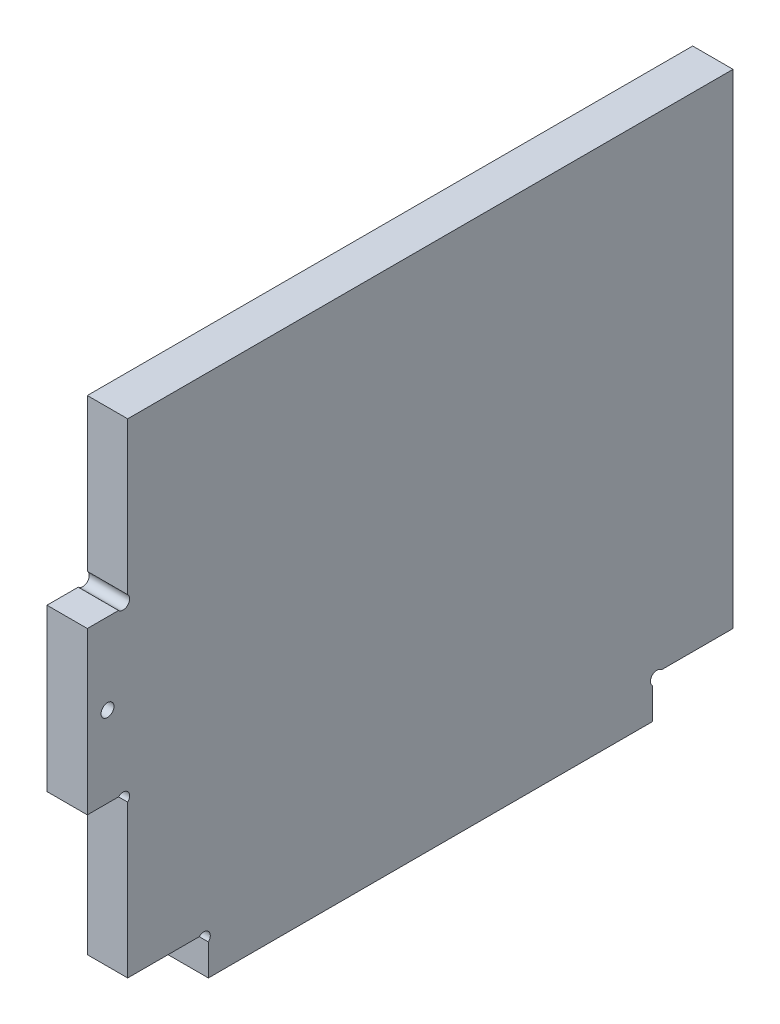
ISO-10303-21;
HEADER;
FILE_DESCRIPTION(('STEP AP214'),'2;1');
FILE_NAME('part.step','',(''),(''),'','','');
FILE_SCHEMA(('AUTOMOTIVE_DESIGN { 1 0 10303 214 1 1 1 1 }'));
ENDSEC;
DATA;
#1=APPLICATION_CONTEXT('core data for automotive mechanical design processes');
#2=APPLICATION_PROTOCOL_DEFINITION('international standard','automotive_design',2000,#1);
#3=PRODUCT_CONTEXT('',#1,'mechanical');
#4=PRODUCT('Part','Part','',(#3));
#5=PRODUCT_RELATED_PRODUCT_CATEGORY('part','',(#4));
#6=PRODUCT_DEFINITION_FORMATION('','',#4);
#7=PRODUCT_DEFINITION_CONTEXT('part definition',#1,'design');
#8=PRODUCT_DEFINITION('design','',#6,#7);
#9=PRODUCT_DEFINITION_SHAPE('','',#8);
#10=(LENGTH_UNIT() NAMED_UNIT(*) SI_UNIT(.MILLI.,.METRE.));
#11=(NAMED_UNIT(*) PLANE_ANGLE_UNIT() SI_UNIT($,.RADIAN.));
#12=(NAMED_UNIT(*) SI_UNIT($,.STERADIAN.) SOLID_ANGLE_UNIT());
#13=UNCERTAINTY_MEASURE_WITH_UNIT(LENGTH_MEASURE(1.E-05),#10,'distance_accuracy_value','');
#14=(GEOMETRIC_REPRESENTATION_CONTEXT(3) GLOBAL_UNCERTAINTY_ASSIGNED_CONTEXT((#13)) GLOBAL_UNIT_ASSIGNED_CONTEXT((#10,
#11,#12)) REPRESENTATION_CONTEXT('',''));
#15=CARTESIAN_POINT('',(0.,0.,0.));
#16=DIRECTION('',(0.,0.,1.));
#17=DIRECTION('',(1.,0.,0.));
#18=AXIS2_PLACEMENT_3D('',#15,#16,#17);
#19=CARTESIAN_POINT('',(10.,8.86862915010153,-141.131370849899));
#20=DIRECTION('',(1.,0.,0.));
#21=DIRECTION('',(0.,0.,-1.));
#22=AXIS2_PLACEMENT_3D('',#19,#20,#21);
#23=PLANE('',#22);
#24=CARTESIAN_POINT('',(10.,8.86862915010153,-141.131370849899));
#25=DIRECTION('',(-1.,0.,0.));
#26=DIRECTION('',(0.,0.,-1.));
#27=AXIS2_PLACEMENT_3D('',#24,#25,#26);
#28=CIRCLE('',#27,1.59999999999999);
#29=CARTESIAN_POINT('',(10.,7.73725830020309,-140.));
#30=VERTEX_POINT('',#29);
#31=CARTESIAN_POINT('',(10.,10.,-142.262741699797));
#32=VERTEX_POINT('',#31);
#33=EDGE_CURVE('E192',#30,#32,#28,.T.);
#34=ORIENTED_EDGE('',*,*,#33,.T.);
#35=DIRECTION('',(0.,0.,-1.));
#36=VECTOR('',#35,1.);
#37=CARTESIAN_POINT('',(10.,10.,-160.));
#38=LINE('',#37,#36);
#39=CARTESIAN_POINT('',(10.,10.,-160.));
#40=VERTEX_POINT('',#39);
#41=EDGE_CURVE('E153',#32,#40,#38,.T.);
#42=ORIENTED_EDGE('',*,*,#41,.T.);
#43=DIRECTION('',(0.,1.,0.));
#44=VECTOR('',#43,1.);
#45=CARTESIAN_POINT('',(10.,130.,-160.));
#46=LINE('',#45,#44);
#47=CARTESIAN_POINT('',(10.,130.,-160.));
#48=VERTEX_POINT('',#47);
#49=EDGE_CURVE('E195',#40,#48,#46,.T.);
#50=ORIENTED_EDGE('',*,*,#49,.T.);
#51=DIRECTION('',(0.,0.,1.));
#52=VECTOR('',#51,1.);
#53=CARTESIAN_POINT('',(10.,130.,-10.));
#54=LINE('',#53,#52);
#55=CARTESIAN_POINT('',(10.,130.,-10.));
#56=VERTEX_POINT('',#55);
#57=EDGE_CURVE('E197',#48,#56,#54,.T.);
#58=ORIENTED_EDGE('',*,*,#57,.T.);
#59=DIRECTION('',(0.,-1.,0.));
#60=VECTOR('',#59,1.);
#61=CARTESIAN_POINT('',(10.,92.262741699797,-10.));
#62=LINE('',#61,#60);
#63=CARTESIAN_POINT('',(10.,92.262741699797,-10.));
#64=VERTEX_POINT('',#63);
#65=EDGE_CURVE('E199',#56,#64,#62,.T.);
#66=ORIENTED_EDGE('',*,*,#65,.T.);
#67=CARTESIAN_POINT('',(10.,91.1313708498985,-8.86862915010154));
#68=DIRECTION('',(-1.,0.,0.));
#69=DIRECTION('',(0.,0.,1.));
#70=AXIS2_PLACEMENT_3D('',#67,#68,#69);
#71=CIRCLE('',#70,1.6);
#72=CARTESIAN_POINT('',(10.,90.,-7.73725830020305));
#73=VERTEX_POINT('',#72);
#74=EDGE_CURVE('E201',#64,#73,#71,.T.);
#75=ORIENTED_EDGE('',*,*,#74,.T.);
#76=DIRECTION('',(0.,0.,1.));
#77=VECTOR('',#76,1.);
#78=CARTESIAN_POINT('',(10.,90.,0.));
#79=LINE('',#78,#77);
#80=CARTESIAN_POINT('',(10.,90.,0.));
#81=VERTEX_POINT('',#80);
#82=EDGE_CURVE('E203',#73,#81,#79,.T.);
#83=ORIENTED_EDGE('',*,*,#82,.T.);
#84=DIRECTION('',(0.,-1.,0.));
#85=VECTOR('',#84,1.);
#86=CARTESIAN_POINT('',(10.,50.,0.));
#87=LINE('',#86,#85);
#88=CARTESIAN_POINT('',(10.,50.,0.));
#89=VERTEX_POINT('',#88);
#90=EDGE_CURVE('E205',#81,#89,#87,.T.);
#91=ORIENTED_EDGE('',*,*,#90,.T.);
#92=DIRECTION('',(0.,0.,-1.));
#93=VECTOR('',#92,1.);
#94=CARTESIAN_POINT('',(10.,50.,0.));
#95=LINE('',#94,#93);
#96=CARTESIAN_POINT('',(10.,50.,-7.73725830020305));
#97=VERTEX_POINT('',#96);
#98=EDGE_CURVE('E207',#89,#97,#95,.T.);
#99=ORIENTED_EDGE('',*,*,#98,.T.);
#100=CARTESIAN_POINT('',(10.,48.8686291501015,-8.86862915010154));
#101=DIRECTION('',(-1.,0.,0.));
#102=DIRECTION('',(0.,0.,-1.));
#103=AXIS2_PLACEMENT_3D('',#100,#101,#102);
#104=CIRCLE('',#103,1.6);
#105=CARTESIAN_POINT('',(10.,47.7372583002031,-10.));
#106=VERTEX_POINT('',#105);
#107=EDGE_CURVE('E209',#97,#106,#104,.T.);
#108=ORIENTED_EDGE('',*,*,#107,.T.);
#109=DIRECTION('',(0.,-1.,0.));
#110=VECTOR('',#109,1.);
#111=CARTESIAN_POINT('',(10.,10.,-10.));
#112=LINE('',#111,#110);
#113=CARTESIAN_POINT('',(10.,10.,-10.));
#114=VERTEX_POINT('',#113);
#115=EDGE_CURVE('E211',#106,#114,#112,.T.);
#116=ORIENTED_EDGE('',*,*,#115,.T.);
#117=DIRECTION('',(0.,0.,-1.));
#118=VECTOR('',#117,1.);
#119=CARTESIAN_POINT('',(10.,10.,-27.7372583002031));
#120=LINE('',#119,#118);
#121=CARTESIAN_POINT('',(10.,10.,-27.7372583002031));
#122=VERTEX_POINT('',#121);
#123=EDGE_CURVE('E213',#114,#122,#120,.T.);
#124=ORIENTED_EDGE('',*,*,#123,.T.);
#125=CARTESIAN_POINT('',(10.,8.86862915010153,-28.8686291501015));
#126=DIRECTION('',(-1.,0.,0.));
#127=DIRECTION('',(0.,0.,1.));
#128=AXIS2_PLACEMENT_3D('',#125,#126,#127);
#129=CIRCLE('',#128,1.59999999999999);
#130=CARTESIAN_POINT('',(10.,7.73725830020309,-30.));
#131=VERTEX_POINT('',#130);
#132=EDGE_CURVE('E215',#122,#131,#129,.T.);
#133=ORIENTED_EDGE('',*,*,#132,.T.);
#134=DIRECTION('',(0.,-1.,0.));
#135=VECTOR('',#134,1.);
#136=CARTESIAN_POINT('',(10.,7.73725830020309,-30.));
#137=LINE('',#136,#135);
#138=CARTESIAN_POINT('',(10.,0.,-30.));
#139=VERTEX_POINT('',#138);
#140=EDGE_CURVE('E217',#131,#139,#137,.T.);
#141=ORIENTED_EDGE('',*,*,#140,.T.);
#142=DIRECTION('',(0.,0.,-1.));
#143=VECTOR('',#142,1.);
#144=CARTESIAN_POINT('',(10.,0.,-30.));
#145=LINE('',#144,#143);
#146=CARTESIAN_POINT('',(10.,0.,-140.));
#147=VERTEX_POINT('',#146);
#148=EDGE_CURVE('E46',#139,#147,#145,.T.);
#149=ORIENTED_EDGE('',*,*,#148,.T.);
#150=DIRECTION('',(0.,1.,0.));
#151=VECTOR('',#150,1.);
#152=CARTESIAN_POINT('',(10.,7.73725830020309,-140.));
#153=LINE('',#152,#151);
#154=EDGE_CURVE('E41',#147,#30,#153,.T.);
#155=ORIENTED_EDGE('',*,*,#154,.T.);
#156=EDGE_LOOP('',(#34,#42,#50,#58,#66,#75,#83,#91,#99,#108,#116,#124,#133,#141,#149,#155));
#157=FACE_BOUND('',#156,.T.);
#158=CARTESIAN_POINT('',(10.,70.,-5.));
#159=DIRECTION('',(1.,0.,0.));
#160=DIRECTION('',(0.,0.,-1.));
#161=AXIS2_PLACEMENT_3D('',#158,#159,#160);
#162=CIRCLE('',#161,1.6);
#163=CARTESIAN_POINT('',(10.,70.,-6.6));
#164=VERTEX_POINT('',#163);
#165=EDGE_CURVE('E158',#164,#164,#162,.T.);
#166=ORIENTED_EDGE('',*,*,#165,.F.);
#167=EDGE_LOOP('',(#166));
#168=FACE_BOUND('',#167,.T.);
#169=ADVANCED_FACE('F26',(#157,#168),#23,.T.);
#170=CARTESIAN_POINT('',(0.,8.86862915010153,-141.131370849899));
#171=DIRECTION('',(1.,0.,0.));
#172=DIRECTION('',(0.,0.,-1.));
#173=AXIS2_PLACEMENT_3D('',#170,#171,#172);
#174=PLANE('',#173);
#175=CARTESIAN_POINT('',(0.,8.86862915010153,-141.131370849899));
#176=DIRECTION('',(-1.,0.,0.));
#177=DIRECTION('',(0.,0.,-1.));
#178=AXIS2_PLACEMENT_3D('',#175,#176,#177);
#179=CIRCLE('',#178,1.59999999999999);
#180=CARTESIAN_POINT('',(0.,7.73725830020309,-140.));
#181=VERTEX_POINT('',#180);
#182=CARTESIAN_POINT('',(0.,10.,-142.262741699797));
#183=VERTEX_POINT('',#182);
#184=EDGE_CURVE('E144',#181,#183,#179,.T.);
#185=ORIENTED_EDGE('',*,*,#184,.F.);
#186=DIRECTION('',(0.,1.,0.));
#187=VECTOR('',#186,1.);
#188=CARTESIAN_POINT('',(0.,7.73725830020309,-140.));
#189=LINE('',#188,#187);
#190=CARTESIAN_POINT('',(0.,0.,-140.));
#191=VERTEX_POINT('',#190);
#192=EDGE_CURVE('E190',#191,#181,#189,.T.);
#193=ORIENTED_EDGE('',*,*,#192,.F.);
#194=DIRECTION('',(0.,0.,-1.));
#195=VECTOR('',#194,1.);
#196=CARTESIAN_POINT('',(0.,0.,-30.));
#197=LINE('',#196,#195);
#198=CARTESIAN_POINT('',(0.,0.,-30.));
#199=VERTEX_POINT('',#198);
#200=EDGE_CURVE('E188',#199,#191,#197,.T.);
#201=ORIENTED_EDGE('',*,*,#200,.F.);
#202=DIRECTION('',(0.,-1.,0.));
#203=VECTOR('',#202,1.);
#204=CARTESIAN_POINT('',(0.,7.73725830020309,-30.));
#205=LINE('',#204,#203);
#206=CARTESIAN_POINT('',(0.,7.73725830020309,-30.));
#207=VERTEX_POINT('',#206);
#208=EDGE_CURVE('E186',#207,#199,#205,.T.);
#209=ORIENTED_EDGE('',*,*,#208,.F.);
#210=CARTESIAN_POINT('',(0.,8.86862915010153,-28.8686291501015));
#211=DIRECTION('',(-1.,0.,0.));
#212=DIRECTION('',(0.,0.,1.));
#213=AXIS2_PLACEMENT_3D('',#210,#211,#212);
#214=CIRCLE('',#213,1.59999999999999);
#215=CARTESIAN_POINT('',(0.,10.,-27.7372583002031));
#216=VERTEX_POINT('',#215);
#217=EDGE_CURVE('E184',#216,#207,#214,.T.);
#218=ORIENTED_EDGE('',*,*,#217,.F.);
#219=DIRECTION('',(0.,0.,-1.));
#220=VECTOR('',#219,1.);
#221=CARTESIAN_POINT('',(0.,10.,-27.7372583002031));
#222=LINE('',#221,#220);
#223=CARTESIAN_POINT('',(0.,10.,-10.));
#224=VERTEX_POINT('',#223);
#225=EDGE_CURVE('E182',#224,#216,#222,.T.);
#226=ORIENTED_EDGE('',*,*,#225,.F.);
#227=DIRECTION('',(0.,-1.,0.));
#228=VECTOR('',#227,1.);
#229=CARTESIAN_POINT('',(0.,10.,-10.));
#230=LINE('',#229,#228);
#231=CARTESIAN_POINT('',(0.,47.7372583002031,-10.));
#232=VERTEX_POINT('',#231);
#233=EDGE_CURVE('E180',#232,#224,#230,.T.);
#234=ORIENTED_EDGE('',*,*,#233,.F.);
#235=CARTESIAN_POINT('',(0.,48.8686291501015,-8.86862915010154));
#236=DIRECTION('',(-1.,0.,0.));
#237=DIRECTION('',(0.,0.,-1.));
#238=AXIS2_PLACEMENT_3D('',#235,#236,#237);
#239=CIRCLE('',#238,1.6);
#240=CARTESIAN_POINT('',(0.,50.,-7.73725830020305));
#241=VERTEX_POINT('',#240);
#242=EDGE_CURVE('E178',#241,#232,#239,.T.);
#243=ORIENTED_EDGE('',*,*,#242,.F.);
#244=DIRECTION('',(0.,0.,-1.));
#245=VECTOR('',#244,1.);
#246=CARTESIAN_POINT('',(0.,50.,0.));
#247=LINE('',#246,#245);
#248=CARTESIAN_POINT('',(0.,50.,0.));
#249=VERTEX_POINT('',#248);
#250=EDGE_CURVE('E176',#249,#241,#247,.T.);
#251=ORIENTED_EDGE('',*,*,#250,.F.);
#252=DIRECTION('',(0.,-1.,0.));
#253=VECTOR('',#252,1.);
#254=CARTESIAN_POINT('',(0.,50.,0.));
#255=LINE('',#254,#253);
#256=CARTESIAN_POINT('',(0.,90.,0.));
#257=VERTEX_POINT('',#256);
#258=EDGE_CURVE('E174',#257,#249,#255,.T.);
#259=ORIENTED_EDGE('',*,*,#258,.F.);
#260=DIRECTION('',(0.,0.,1.));
#261=VECTOR('',#260,1.);
#262=CARTESIAN_POINT('',(0.,90.,0.));
#263=LINE('',#262,#261);
#264=CARTESIAN_POINT('',(0.,90.,-7.73725830020305));
#265=VERTEX_POINT('',#264);
#266=EDGE_CURVE('E172',#265,#257,#263,.T.);
#267=ORIENTED_EDGE('',*,*,#266,.F.);
#268=CARTESIAN_POINT('',(0.,91.1313708498985,-8.86862915010154));
#269=DIRECTION('',(-1.,0.,0.));
#270=DIRECTION('',(0.,0.,1.));
#271=AXIS2_PLACEMENT_3D('',#268,#269,#270);
#272=CIRCLE('',#271,1.6);
#273=CARTESIAN_POINT('',(0.,92.262741699797,-10.));
#274=VERTEX_POINT('',#273);
#275=EDGE_CURVE('E170',#274,#265,#272,.T.);
#276=ORIENTED_EDGE('',*,*,#275,.F.);
#277=DIRECTION('',(0.,-1.,0.));
#278=VECTOR('',#277,1.);
#279=CARTESIAN_POINT('',(0.,92.262741699797,-10.));
#280=LINE('',#279,#278);
#281=CARTESIAN_POINT('',(0.,130.,-10.));
#282=VERTEX_POINT('',#281);
#283=EDGE_CURVE('E168',#282,#274,#280,.T.);
#284=ORIENTED_EDGE('',*,*,#283,.F.);
#285=DIRECTION('',(0.,0.,1.));
#286=VECTOR('',#285,1.);
#287=CARTESIAN_POINT('',(0.,130.,-10.));
#288=LINE('',#287,#286);
#289=CARTESIAN_POINT('',(0.,130.,-160.));
#290=VERTEX_POINT('',#289);
#291=EDGE_CURVE('E166',#290,#282,#288,.T.);
#292=ORIENTED_EDGE('',*,*,#291,.F.);
#293=DIRECTION('',(0.,1.,0.));
#294=VECTOR('',#293,1.);
#295=CARTESIAN_POINT('',(0.,130.,-160.));
#296=LINE('',#295,#294);
#297=CARTESIAN_POINT('',(0.,10.,-160.));
#298=VERTEX_POINT('',#297);
#299=EDGE_CURVE('E146',#298,#290,#296,.T.);
#300=ORIENTED_EDGE('',*,*,#299,.F.);
#301=DIRECTION('',(0.,0.,-1.));
#302=VECTOR('',#301,1.);
#303=CARTESIAN_POINT('',(0.,10.,-160.));
#304=LINE('',#303,#302);
#305=EDGE_CURVE('E139',#183,#298,#304,.T.);
#306=ORIENTED_EDGE('',*,*,#305,.F.);
#307=EDGE_LOOP('',(#185,#193,#201,#209,#218,#226,#234,#243,#251,#259,#267,#276,#284,#292,#300,#306));
#308=FACE_BOUND('',#307,.T.);
#309=CARTESIAN_POINT('',(0.,70.,-5.));
#310=DIRECTION('',(1.,0.,0.));
#311=DIRECTION('',(0.,0.,-1.));
#312=AXIS2_PLACEMENT_3D('',#309,#310,#311);
#313=CIRCLE('',#312,1.6);
#314=CARTESIAN_POINT('',(0.,70.,-6.6));
#315=VERTEX_POINT('',#314);
#316=EDGE_CURVE('E161',#315,#315,#313,.T.);
#317=ORIENTED_EDGE('',*,*,#316,.T.);
#318=EDGE_LOOP('',(#317));
#319=FACE_BOUND('',#318,.T.);
#320=ADVANCED_FACE('F140',(#308,#319),#174,.F.);
#321=CARTESIAN_POINT('',(10.,8.86862915010153,-141.131370849899));
#322=DIRECTION('',(-1.,0.,0.));
#323=DIRECTION('',(0.,0.,1.));
#324=AXIS2_PLACEMENT_3D('',#321,#322,#323);
#325=CYLINDRICAL_SURFACE('',#324,1.59999999999999);
#326=ORIENTED_EDGE('',*,*,#184,.T.);
#327=DIRECTION('',(-1.,0.,0.));
#328=VECTOR('',#327,1.);
#329=CARTESIAN_POINT('',(10.,10.,-142.262741699797));
#330=LINE('',#329,#328);
#331=EDGE_CURVE('E11',#32,#183,#330,.T.);
#332=ORIENTED_EDGE('',*,*,#331,.F.);
#333=ORIENTED_EDGE('',*,*,#33,.F.);
#334=DIRECTION('',(-1.,0.,0.));
#335=VECTOR('',#334,1.);
#336=CARTESIAN_POINT('',(10.,7.73725830020309,-140.));
#337=LINE('',#336,#335);
#338=EDGE_CURVE('E157',#30,#181,#337,.T.);
#339=ORIENTED_EDGE('',*,*,#338,.T.);
#340=EDGE_LOOP('',(#326,#332,#333,#339));
#341=FACE_BOUND('',#340,.T.);
#342=ADVANCED_FACE('F28',(#341),#325,.F.);
#343=CARTESIAN_POINT('',(10.,10.,-160.));
#344=DIRECTION('',(0.,1.,0.));
#345=DIRECTION('',(0.,0.,1.));
#346=AXIS2_PLACEMENT_3D('',#343,#344,#345);
#347=PLANE('',#346);
#348=ORIENTED_EDGE('',*,*,#305,.T.);
#349=DIRECTION('',(-1.,0.,0.));
#350=VECTOR('',#349,1.);
#351=CARTESIAN_POINT('',(10.,10.,-160.));
#352=LINE('',#351,#350);
#353=EDGE_CURVE('E34',#40,#298,#352,.T.);
#354=ORIENTED_EDGE('',*,*,#353,.F.);
#355=ORIENTED_EDGE('',*,*,#41,.F.);
#356=ORIENTED_EDGE('',*,*,#331,.T.);
#357=EDGE_LOOP('',(#348,#354,#355,#356));
#358=FACE_BOUND('',#357,.T.);
#359=ADVANCED_FACE('F152',(#358),#347,.F.);
#360=CARTESIAN_POINT('',(10.,130.,-160.));
#361=DIRECTION('',(0.,0.,1.));
#362=DIRECTION('',(1.,0.,0.));
#363=AXIS2_PLACEMENT_3D('',#360,#361,#362);
#364=PLANE('',#363);
#365=ORIENTED_EDGE('',*,*,#299,.T.);
#366=DIRECTION('',(-1.,0.,0.));
#367=VECTOR('',#366,1.);
#368=CARTESIAN_POINT('',(10.,130.,-160.));
#369=LINE('',#368,#367);
#370=EDGE_CURVE('E258',#48,#290,#369,.T.);
#371=ORIENTED_EDGE('',*,*,#370,.F.);
#372=ORIENTED_EDGE('',*,*,#49,.F.);
#373=ORIENTED_EDGE('',*,*,#353,.T.);
#374=EDGE_LOOP('',(#365,#371,#372,#373));
#375=FACE_BOUND('',#374,.T.);
#376=ADVANCED_FACE('F262',(#375),#364,.F.);
#377=CARTESIAN_POINT('',(10.,130.,-10.));
#378=DIRECTION('',(0.,-1.,0.));
#379=DIRECTION('',(0.,0.,-1.));
#380=AXIS2_PLACEMENT_3D('',#377,#378,#379);
#381=PLANE('',#380);
#382=ORIENTED_EDGE('',*,*,#291,.T.);
#383=DIRECTION('',(-1.,0.,0.));
#384=VECTOR('',#383,1.);
#385=CARTESIAN_POINT('',(10.,130.,-10.));
#386=LINE('',#385,#384);
#387=EDGE_CURVE('E255',#56,#282,#386,.T.);
#388=ORIENTED_EDGE('',*,*,#387,.F.);
#389=ORIENTED_EDGE('',*,*,#57,.F.);
#390=ORIENTED_EDGE('',*,*,#370,.T.);
#391=EDGE_LOOP('',(#382,#388,#389,#390));
#392=FACE_BOUND('',#391,.T.);
#393=ADVANCED_FACE('F270',(#392),#381,.F.);
#394=CARTESIAN_POINT('',(10.,92.262741699797,-10.));
#395=DIRECTION('',(0.,0.,-1.));
#396=DIRECTION('',(0.,1.,0.));
#397=AXIS2_PLACEMENT_3D('',#394,#395,#396);
#398=PLANE('',#397);
#399=ORIENTED_EDGE('',*,*,#283,.T.);
#400=DIRECTION('',(-1.,0.,0.));
#401=VECTOR('',#400,1.);
#402=CARTESIAN_POINT('',(10.,92.262741699797,-10.));
#403=LINE('',#402,#401);
#404=EDGE_CURVE('E252',#64,#274,#403,.T.);
#405=ORIENTED_EDGE('',*,*,#404,.F.);
#406=ORIENTED_EDGE('',*,*,#65,.F.);
#407=ORIENTED_EDGE('',*,*,#387,.T.);
#408=EDGE_LOOP('',(#399,#405,#406,#407));
#409=FACE_BOUND('',#408,.T.);
#410=ADVANCED_FACE('F273',(#409),#398,.F.);
#411=CARTESIAN_POINT('',(10.,91.1313708498985,-8.86862915010154));
#412=DIRECTION('',(-1.,0.,0.));
#413=DIRECTION('',(0.,0.,1.));
#414=AXIS2_PLACEMENT_3D('',#411,#412,#413);
#415=CYLINDRICAL_SURFACE('',#414,1.6);
#416=ORIENTED_EDGE('',*,*,#275,.T.);
#417=DIRECTION('',(-1.,0.,0.));
#418=VECTOR('',#417,1.);
#419=CARTESIAN_POINT('',(10.,90.,-7.73725830020305));
#420=LINE('',#419,#418);
#421=EDGE_CURVE('E249',#73,#265,#420,.T.);
#422=ORIENTED_EDGE('',*,*,#421,.F.);
#423=ORIENTED_EDGE('',*,*,#74,.F.);
#424=ORIENTED_EDGE('',*,*,#404,.T.);
#425=EDGE_LOOP('',(#416,#422,#423,#424));
#426=FACE_BOUND('',#425,.T.);
#427=ADVANCED_FACE('F278',(#426),#415,.F.);
#428=CARTESIAN_POINT('',(10.,90.,0.));
#429=DIRECTION('',(0.,-1.,0.));
#430=DIRECTION('',(0.,0.,-1.));
#431=AXIS2_PLACEMENT_3D('',#428,#429,#430);
#432=PLANE('',#431);
#433=ORIENTED_EDGE('',*,*,#266,.T.);
#434=DIRECTION('',(-1.,0.,0.));
#435=VECTOR('',#434,1.);
#436=CARTESIAN_POINT('',(10.,90.,0.));
#437=LINE('',#436,#435);
#438=EDGE_CURVE('E246',#81,#257,#437,.T.);
#439=ORIENTED_EDGE('',*,*,#438,.F.);
#440=ORIENTED_EDGE('',*,*,#82,.F.);
#441=ORIENTED_EDGE('',*,*,#421,.T.);
#442=EDGE_LOOP('',(#433,#439,#440,#441));
#443=FACE_BOUND('',#442,.T.);
#444=ADVANCED_FACE('F284',(#443),#432,.F.);
#445=CARTESIAN_POINT('',(10.,50.,0.));
#446=DIRECTION('',(0.,0.,-1.));
#447=DIRECTION('',(-1.,0.,0.));
#448=AXIS2_PLACEMENT_3D('',#445,#446,#447);
#449=PLANE('',#448);
#450=ORIENTED_EDGE('',*,*,#258,.T.);
#451=DIRECTION('',(-1.,0.,0.));
#452=VECTOR('',#451,1.);
#453=CARTESIAN_POINT('',(10.,50.,0.));
#454=LINE('',#453,#452);
#455=EDGE_CURVE('E243',#89,#249,#454,.T.);
#456=ORIENTED_EDGE('',*,*,#455,.F.);
#457=ORIENTED_EDGE('',*,*,#90,.F.);
#458=ORIENTED_EDGE('',*,*,#438,.T.);
#459=EDGE_LOOP('',(#450,#456,#457,#458));
#460=FACE_BOUND('',#459,.T.);
#461=ADVANCED_FACE('F288',(#460),#449,.F.);
#462=CARTESIAN_POINT('',(10.,50.,0.));
#463=DIRECTION('',(0.,1.,0.));
#464=DIRECTION('',(0.,0.,1.));
#465=AXIS2_PLACEMENT_3D('',#462,#463,#464);
#466=PLANE('',#465);
#467=ORIENTED_EDGE('',*,*,#250,.T.);
#468=DIRECTION('',(-1.,0.,0.));
#469=VECTOR('',#468,1.);
#470=CARTESIAN_POINT('',(10.,50.,-7.73725830020305));
#471=LINE('',#470,#469);
#472=EDGE_CURVE('E240',#97,#241,#471,.T.);
#473=ORIENTED_EDGE('',*,*,#472,.F.);
#474=ORIENTED_EDGE('',*,*,#98,.F.);
#475=ORIENTED_EDGE('',*,*,#455,.T.);
#476=EDGE_LOOP('',(#467,#473,#474,#475));
#477=FACE_BOUND('',#476,.T.);
#478=ADVANCED_FACE('F293',(#477),#466,.F.);
#479=CARTESIAN_POINT('',(10.,48.8686291501015,-8.86862915010154));
#480=DIRECTION('',(-1.,0.,0.));
#481=DIRECTION('',(0.,0.,1.));
#482=AXIS2_PLACEMENT_3D('',#479,#480,#481);
#483=CYLINDRICAL_SURFACE('',#482,1.6);
#484=ORIENTED_EDGE('',*,*,#242,.T.);
#485=DIRECTION('',(-1.,0.,0.));
#486=VECTOR('',#485,1.);
#487=CARTESIAN_POINT('',(10.,47.7372583002031,-10.));
#488=LINE('',#487,#486);
#489=EDGE_CURVE('E237',#106,#232,#488,.T.);
#490=ORIENTED_EDGE('',*,*,#489,.F.);
#491=ORIENTED_EDGE('',*,*,#107,.F.);
#492=ORIENTED_EDGE('',*,*,#472,.T.);
#493=EDGE_LOOP('',(#484,#490,#491,#492));
#494=FACE_BOUND('',#493,.T.);
#495=ADVANCED_FACE('F299',(#494),#483,.F.);
#496=CARTESIAN_POINT('',(10.,10.,-10.));
#497=DIRECTION('',(0.,0.,-1.));
#498=DIRECTION('',(0.,1.,0.));
#499=AXIS2_PLACEMENT_3D('',#496,#497,#498);
#500=PLANE('',#499);
#501=ORIENTED_EDGE('',*,*,#233,.T.);
#502=DIRECTION('',(-1.,0.,0.));
#503=VECTOR('',#502,1.);
#504=CARTESIAN_POINT('',(10.,10.,-10.));
#505=LINE('',#504,#503);
#506=EDGE_CURVE('E234',#114,#224,#505,.T.);
#507=ORIENTED_EDGE('',*,*,#506,.F.);
#508=ORIENTED_EDGE('',*,*,#115,.F.);
#509=ORIENTED_EDGE('',*,*,#489,.T.);
#510=EDGE_LOOP('',(#501,#507,#508,#509));
#511=FACE_BOUND('',#510,.T.);
#512=ADVANCED_FACE('F303',(#511),#500,.F.);
#513=CARTESIAN_POINT('',(10.,10.,-27.7372583002031));
#514=DIRECTION('',(0.,1.,0.));
#515=DIRECTION('',(0.,0.,1.));
#516=AXIS2_PLACEMENT_3D('',#513,#514,#515);
#517=PLANE('',#516);
#518=ORIENTED_EDGE('',*,*,#225,.T.);
#519=DIRECTION('',(-1.,0.,0.));
#520=VECTOR('',#519,1.);
#521=CARTESIAN_POINT('',(10.,10.,-27.7372583002031));
#522=LINE('',#521,#520);
#523=EDGE_CURVE('E231',#122,#216,#522,.T.);
#524=ORIENTED_EDGE('',*,*,#523,.F.);
#525=ORIENTED_EDGE('',*,*,#123,.F.);
#526=ORIENTED_EDGE('',*,*,#506,.T.);
#527=EDGE_LOOP('',(#518,#524,#525,#526));
#528=FACE_BOUND('',#527,.T.);
#529=ADVANCED_FACE('F308',(#528),#517,.F.);
#530=CARTESIAN_POINT('',(10.,8.86862915010153,-28.8686291501015));
#531=DIRECTION('',(-1.,0.,0.));
#532=DIRECTION('',(0.,0.,1.));
#533=AXIS2_PLACEMENT_3D('',#530,#531,#532);
#534=CYLINDRICAL_SURFACE('',#533,1.59999999999999);
#535=ORIENTED_EDGE('',*,*,#217,.T.);
#536=DIRECTION('',(-1.,0.,0.));
#537=VECTOR('',#536,1.);
#538=CARTESIAN_POINT('',(10.,7.73725830020309,-30.));
#539=LINE('',#538,#537);
#540=EDGE_CURVE('E228',#131,#207,#539,.T.);
#541=ORIENTED_EDGE('',*,*,#540,.F.);
#542=ORIENTED_EDGE('',*,*,#132,.F.);
#543=ORIENTED_EDGE('',*,*,#523,.T.);
#544=EDGE_LOOP('',(#535,#541,#542,#543));
#545=FACE_BOUND('',#544,.T.);
#546=ADVANCED_FACE('F314',(#545),#534,.F.);
#547=CARTESIAN_POINT('',(10.,7.73725830020309,-30.));
#548=DIRECTION('',(0.,0.,-1.));
#549=DIRECTION('',(-1.,0.,0.));
#550=AXIS2_PLACEMENT_3D('',#547,#548,#549);
#551=PLANE('',#550);
#552=ORIENTED_EDGE('',*,*,#208,.T.);
#553=DIRECTION('',(-1.,0.,0.));
#554=VECTOR('',#553,1.);
#555=CARTESIAN_POINT('',(10.,0.,-30.));
#556=LINE('',#555,#554);
#557=EDGE_CURVE('E225',#139,#199,#556,.T.);
#558=ORIENTED_EDGE('',*,*,#557,.F.);
#559=ORIENTED_EDGE('',*,*,#140,.F.);
#560=ORIENTED_EDGE('',*,*,#540,.T.);
#561=EDGE_LOOP('',(#552,#558,#559,#560));
#562=FACE_BOUND('',#561,.T.);
#563=ADVANCED_FACE('F318',(#562),#551,.F.);
#564=CARTESIAN_POINT('',(10.,0.,-30.));
#565=DIRECTION('',(0.,1.,0.));
#566=DIRECTION('',(0.,0.,1.));
#567=AXIS2_PLACEMENT_3D('',#564,#565,#566);
#568=PLANE('',#567);
#569=ORIENTED_EDGE('',*,*,#200,.T.);
#570=DIRECTION('',(-1.,0.,0.));
#571=VECTOR('',#570,1.);
#572=CARTESIAN_POINT('',(10.,0.,-140.));
#573=LINE('',#572,#571);
#574=EDGE_CURVE('E222',#147,#191,#573,.T.);
#575=ORIENTED_EDGE('',*,*,#574,.F.);
#576=ORIENTED_EDGE('',*,*,#148,.F.);
#577=ORIENTED_EDGE('',*,*,#557,.T.);
#578=EDGE_LOOP('',(#569,#575,#576,#577));
#579=FACE_BOUND('',#578,.T.);
#580=ADVANCED_FACE('F321',(#579),#568,.F.);
#581=CARTESIAN_POINT('',(10.,7.73725830020309,-140.));
#582=DIRECTION('',(0.,0.,1.));
#583=DIRECTION('',(1.,0.,0.));
#584=AXIS2_PLACEMENT_3D('',#581,#582,#583);
#585=PLANE('',#584);
#586=ORIENTED_EDGE('',*,*,#192,.T.);
#587=ORIENTED_EDGE('',*,*,#338,.F.);
#588=ORIENTED_EDGE('',*,*,#154,.F.);
#589=ORIENTED_EDGE('',*,*,#574,.T.);
#590=EDGE_LOOP('',(#586,#587,#588,#589));
#591=FACE_BOUND('',#590,.T.);
#592=ADVANCED_FACE('F323',(#591),#585,.F.);
#593=CARTESIAN_POINT('',(10.,70.,-5.));
#594=DIRECTION('',(-1.,0.,0.));
#595=DIRECTION('',(0.,0.,1.));
#596=AXIS2_PLACEMENT_3D('',#593,#594,#595);
#597=CYLINDRICAL_SURFACE('',#596,1.6);
#598=ORIENTED_EDGE('',*,*,#165,.T.);
#599=EDGE_LOOP('',(#598));
#600=FACE_BOUND('',#599,.T.);
#601=ORIENTED_EDGE('',*,*,#316,.F.);
#602=EDGE_LOOP('',(#601));
#603=FACE_BOUND('',#602,.T.);
#604=ADVANCED_FACE('F325',(#600,#603),#597,.F.);
#605=CLOSED_SHELL('',(#169,#320,#342,#359,#376,#393,#410,#427,#444,#461,#478,#495,#512,#529,
#546,#563,#580,#592,#604));
#606=MANIFOLD_SOLID_BREP('B2',#605);
#607=ADVANCED_BREP_SHAPE_REPRESENTATION('',(#18,#606),#14);
#608=SHAPE_DEFINITION_REPRESENTATION(#9,#607);
ENDSEC;
END-ISO-10303-21;
